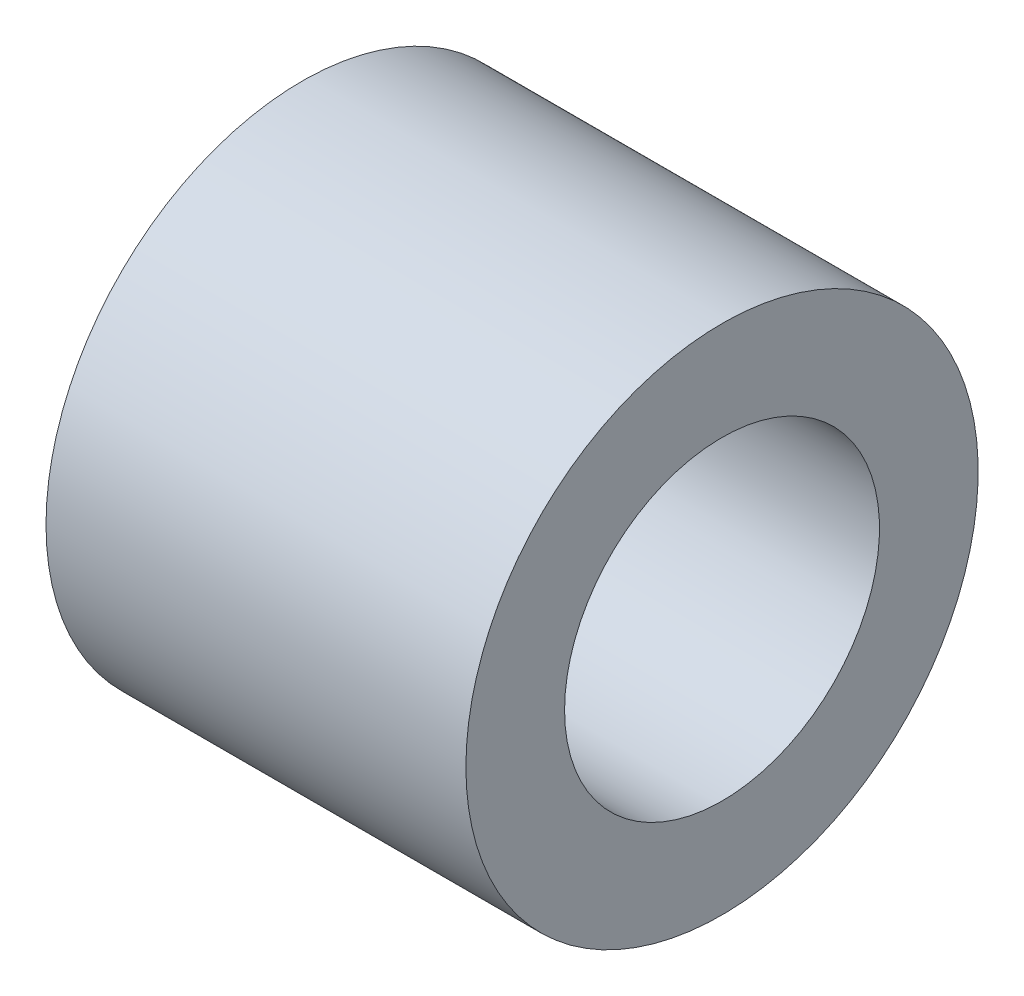
ISO-10303-21;
HEADER;
FILE_DESCRIPTION(('STEP AP214'),'2;1');
FILE_NAME('part.step','',(''),(''),'','','');
FILE_SCHEMA(('AUTOMOTIVE_DESIGN { 1 0 10303 214 1 1 1 1 }'));
ENDSEC;
DATA;
#1=APPLICATION_CONTEXT('core data for automotive mechanical design processes');
#2=APPLICATION_PROTOCOL_DEFINITION('international standard','automotive_design',2000,#1);
#3=PRODUCT_CONTEXT('',#1,'mechanical');
#4=PRODUCT('Part','Part','',(#3));
#5=PRODUCT_RELATED_PRODUCT_CATEGORY('part','',(#4));
#6=PRODUCT_DEFINITION_FORMATION('','',#4);
#7=PRODUCT_DEFINITION_CONTEXT('part definition',#1,'design');
#8=PRODUCT_DEFINITION('design','',#6,#7);
#9=PRODUCT_DEFINITION_SHAPE('','',#8);
#10=(LENGTH_UNIT() NAMED_UNIT(*) SI_UNIT(.MILLI.,.METRE.));
#11=(NAMED_UNIT(*) PLANE_ANGLE_UNIT() SI_UNIT($,.RADIAN.));
#12=(NAMED_UNIT(*) SI_UNIT($,.STERADIAN.) SOLID_ANGLE_UNIT());
#13=UNCERTAINTY_MEASURE_WITH_UNIT(LENGTH_MEASURE(1.E-05),#10,'distance_accuracy_value','');
#14=(GEOMETRIC_REPRESENTATION_CONTEXT(3) GLOBAL_UNCERTAINTY_ASSIGNED_CONTEXT((#13)) GLOBAL_UNIT_ASSIGNED_CONTEXT((#10,
#11,#12)) REPRESENTATION_CONTEXT('',''));
#15=CARTESIAN_POINT('',(0.,0.,0.));
#16=DIRECTION('',(0.,0.,1.));
#17=DIRECTION('',(1.,0.,0.));
#18=AXIS2_PLACEMENT_3D('',#15,#16,#17);
#19=CARTESIAN_POINT('',(0.,0.,-3.8735));
#20=DIRECTION('',(1.,0.,0.));
#21=DIRECTION('',(0.,0.,-1.));
#22=AXIS2_PLACEMENT_3D('',#19,#20,#21);
#23=PLANE('',#22);
#24=CARTESIAN_POINT('',(0.,0.,0.));
#25=DIRECTION('',(-1.,0.,0.));
#26=DIRECTION('',(0.,0.,1.));
#27=AXIS2_PLACEMENT_3D('',#24,#25,#26);
#28=CIRCLE('',#27,2.38125);
#29=CARTESIAN_POINT('',(0.,0.,2.38125));
#30=VERTEX_POINT('',#29);
#31=EDGE_CURVE('E10',#30,#30,#28,.T.);
#32=ORIENTED_EDGE('',*,*,#31,.F.);
#33=EDGE_LOOP('',(#32));
#34=FACE_BOUND('',#33,.T.);
#35=CARTESIAN_POINT('',(0.,0.,0.));
#36=DIRECTION('',(-1.,0.,0.));
#37=DIRECTION('',(0.,0.,1.));
#38=AXIS2_PLACEMENT_3D('',#35,#36,#37);
#39=CIRCLE('',#38,3.8735);
#40=CARTESIAN_POINT('',(0.,0.,3.8735));
#41=VERTEX_POINT('',#40);
#42=EDGE_CURVE('E45',#41,#41,#39,.T.);
#43=ORIENTED_EDGE('',*,*,#42,.T.);
#44=EDGE_LOOP('',(#43));
#45=FACE_BOUND('',#44,.T.);
#46=ADVANCED_FACE('F31',(#34,#45),#23,.F.);
#47=CARTESIAN_POINT('',(0.,0.,0.));
#48=DIRECTION('',(-1.,0.,0.));
#49=DIRECTION('',(0.,0.,1.));
#50=AXIS2_PLACEMENT_3D('',#47,#48,#49);
#51=CYLINDRICAL_SURFACE('',#50,2.38125);
#52=CARTESIAN_POINT('',(6.35,0.,0.));
#53=DIRECTION('',(-1.,0.,0.));
#54=DIRECTION('',(0.,0.,1.));
#55=AXIS2_PLACEMENT_3D('',#52,#53,#54);
#56=CIRCLE('',#55,2.38125);
#57=CARTESIAN_POINT('',(6.35,0.,2.38125));
#58=VERTEX_POINT('',#57);
#59=EDGE_CURVE('E37',#58,#58,#56,.T.);
#60=ORIENTED_EDGE('',*,*,#59,.F.);
#61=EDGE_LOOP('',(#60));
#62=FACE_BOUND('',#61,.T.);
#63=ORIENTED_EDGE('',*,*,#31,.T.);
#64=EDGE_LOOP('',(#63));
#65=FACE_BOUND('',#64,.T.);
#66=ADVANCED_FACE('F60',(#62,#65),#51,.F.);
#67=CARTESIAN_POINT('',(6.35,0.,-2.38125));
#68=DIRECTION('',(-1.,0.,0.));
#69=DIRECTION('',(0.,0.,1.));
#70=AXIS2_PLACEMENT_3D('',#67,#68,#69);
#71=PLANE('',#70);
#72=CARTESIAN_POINT('',(6.35,0.,0.));
#73=DIRECTION('',(-1.,0.,0.));
#74=DIRECTION('',(0.,0.,1.));
#75=AXIS2_PLACEMENT_3D('',#72,#73,#74);
#76=CIRCLE('',#75,3.8735);
#77=CARTESIAN_POINT('',(6.35,0.,3.8735));
#78=VERTEX_POINT('',#77);
#79=EDGE_CURVE('E41',#78,#78,#76,.T.);
#80=ORIENTED_EDGE('',*,*,#79,.F.);
#81=EDGE_LOOP('',(#80));
#82=FACE_BOUND('',#81,.T.);
#83=ORIENTED_EDGE('',*,*,#59,.T.);
#84=EDGE_LOOP('',(#83));
#85=FACE_BOUND('',#84,.T.);
#86=ADVANCED_FACE('F55',(#82,#85),#71,.F.);
#87=CARTESIAN_POINT('',(0.,0.,0.));
#88=DIRECTION('',(-1.,0.,0.));
#89=DIRECTION('',(0.,0.,1.));
#90=AXIS2_PLACEMENT_3D('',#87,#88,#89);
#91=CYLINDRICAL_SURFACE('',#90,3.8735);
#92=ORIENTED_EDGE('',*,*,#42,.F.);
#93=EDGE_LOOP('',(#92));
#94=FACE_BOUND('',#93,.T.);
#95=ORIENTED_EDGE('',*,*,#79,.T.);
#96=EDGE_LOOP('',(#95));
#97=FACE_BOUND('',#96,.T.);
#98=ADVANCED_FACE('F52',(#94,#97),#91,.T.);
#99=CLOSED_SHELL('',(#46,#66,#86,#98));
#100=MANIFOLD_SOLID_BREP('B2',#99);
#101=ADVANCED_BREP_SHAPE_REPRESENTATION('',(#18,#100),#14);
#102=SHAPE_DEFINITION_REPRESENTATION(#9,#101);
ENDSEC;
END-ISO-10303-21;
